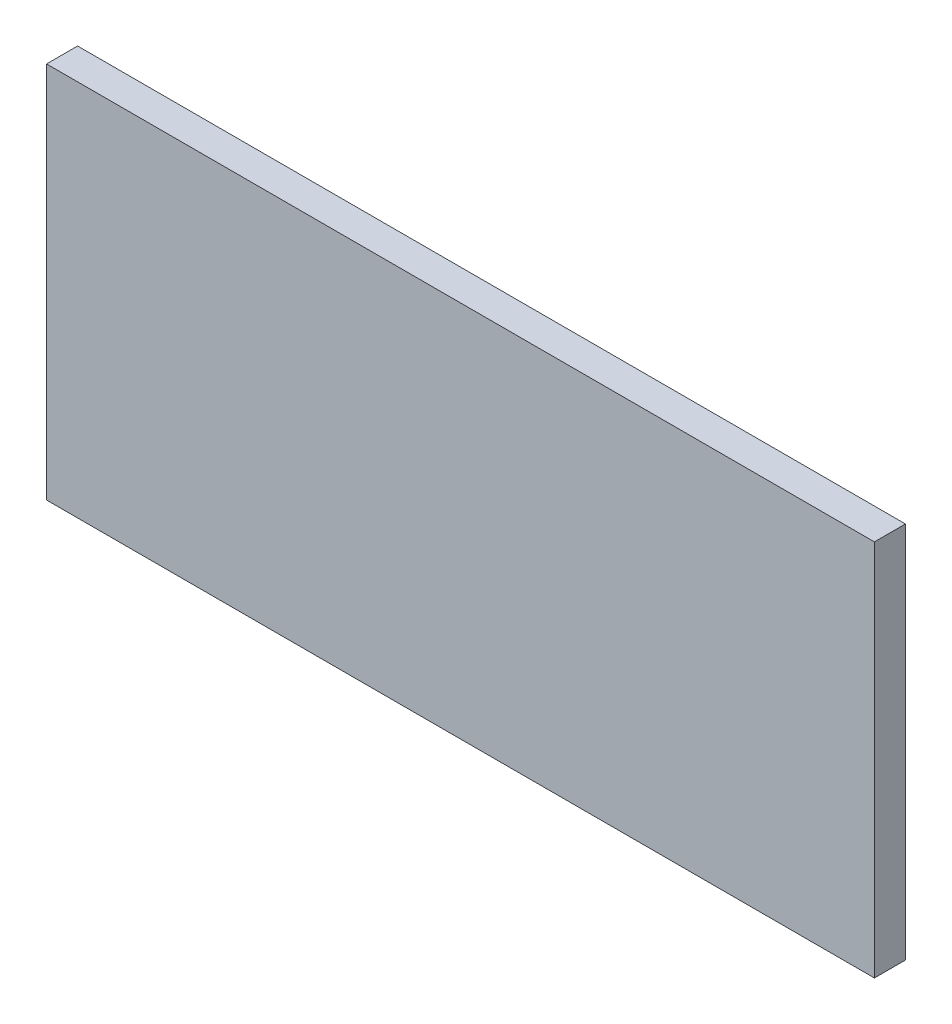
ISO-10303-21;
HEADER;
FILE_DESCRIPTION(('STEP AP214'),'2;1');
FILE_NAME('part.step','',(''),(''),'','','');
FILE_SCHEMA(('AUTOMOTIVE_DESIGN { 1 0 10303 214 1 1 1 1 }'));
ENDSEC;
DATA;
#1=APPLICATION_CONTEXT('core data for automotive mechanical design processes');
#2=APPLICATION_PROTOCOL_DEFINITION('international standard','automotive_design',2000,#1);
#3=PRODUCT_CONTEXT('',#1,'mechanical');
#4=PRODUCT('Part','Part','',(#3));
#5=PRODUCT_RELATED_PRODUCT_CATEGORY('part','',(#4));
#6=PRODUCT_DEFINITION_FORMATION('','',#4);
#7=PRODUCT_DEFINITION_CONTEXT('part definition',#1,'design');
#8=PRODUCT_DEFINITION('design','',#6,#7);
#9=PRODUCT_DEFINITION_SHAPE('','',#8);
#10=(LENGTH_UNIT() NAMED_UNIT(*) SI_UNIT(.MILLI.,.METRE.));
#11=(NAMED_UNIT(*) PLANE_ANGLE_UNIT() SI_UNIT($,.RADIAN.));
#12=(NAMED_UNIT(*) SI_UNIT($,.STERADIAN.) SOLID_ANGLE_UNIT());
#13=UNCERTAINTY_MEASURE_WITH_UNIT(LENGTH_MEASURE(1.E-05),#10,'distance_accuracy_value','');
#14=(GEOMETRIC_REPRESENTATION_CONTEXT(3) GLOBAL_UNCERTAINTY_ASSIGNED_CONTEXT((#13)) GLOBAL_UNIT_ASSIGNED_CONTEXT((#10,
#11,#12)) REPRESENTATION_CONTEXT('',''));
#15=CARTESIAN_POINT('',(0.,0.,0.));
#16=DIRECTION('',(0.,0.,1.));
#17=DIRECTION('',(1.,0.,0.));
#18=AXIS2_PLACEMENT_3D('',#15,#16,#17);
#19=CARTESIAN_POINT('',(0.,0.,-3.00000000000001));
#20=DIRECTION('',(-1.,0.,0.));
#21=DIRECTION('',(0.,0.,1.));
#22=AXIS2_PLACEMENT_3D('',#19,#20,#21);
#23=PLANE('',#22);
#24=DIRECTION('',(0.,-1.,0.));
#25=VECTOR('',#24,1.);
#26=CARTESIAN_POINT('',(0.,0.,0.));
#27=LINE('',#26,#25);
#28=CARTESIAN_POINT('',(0.,36.5,0.));
#29=VERTEX_POINT('',#28);
#30=CARTESIAN_POINT('',(0.,0.,0.));
#31=VERTEX_POINT('',#30);
#32=EDGE_CURVE('E97',#29,#31,#27,.T.);
#33=ORIENTED_EDGE('',*,*,#32,.F.);
#34=DIRECTION('',(0.,0.,1.));
#35=VECTOR('',#34,1.);
#36=CARTESIAN_POINT('',(0.,36.5,-3.00000000000001));
#37=LINE('',#36,#35);
#38=CARTESIAN_POINT('',(0.,36.5,-3.00000000000001));
#39=VERTEX_POINT('',#38);
#40=EDGE_CURVE('E11',#39,#29,#37,.T.);
#41=ORIENTED_EDGE('',*,*,#40,.F.);
#42=DIRECTION('',(0.,-1.,0.));
#43=VECTOR('',#42,1.);
#44=CARTESIAN_POINT('',(0.,0.,-3.00000000000001));
#45=LINE('',#44,#43);
#46=CARTESIAN_POINT('',(0.,0.,-3.00000000000001));
#47=VERTEX_POINT('',#46);
#48=EDGE_CURVE('E91',#39,#47,#45,.T.);
#49=ORIENTED_EDGE('',*,*,#48,.T.);
#50=DIRECTION('',(0.,0.,1.));
#51=VECTOR('',#50,1.);
#52=CARTESIAN_POINT('',(0.,0.,-3.00000000000001));
#53=LINE('',#52,#51);
#54=EDGE_CURVE('E36',#47,#31,#53,.T.);
#55=ORIENTED_EDGE('',*,*,#54,.T.);
#56=EDGE_LOOP('',(#33,#41,#49,#55));
#57=FACE_BOUND('',#56,.T.);
#58=ADVANCED_FACE('F33',(#57),#23,.T.);
#59=CARTESIAN_POINT('',(0.,36.5,-3.00000000000001));
#60=DIRECTION('',(0.,1.,0.));
#61=DIRECTION('',(0.,0.,1.));
#62=AXIS2_PLACEMENT_3D('',#59,#60,#61);
#63=PLANE('',#62);
#64=DIRECTION('',(-1.,0.,0.));
#65=VECTOR('',#64,1.);
#66=CARTESIAN_POINT('',(0.,36.5,0.));
#67=LINE('',#66,#65);
#68=CARTESIAN_POINT('',(80.,36.5,0.));
#69=VERTEX_POINT('',#68);
#70=EDGE_CURVE('E93',#69,#29,#67,.T.);
#71=ORIENTED_EDGE('',*,*,#70,.F.);
#72=DIRECTION('',(0.,0.,1.));
#73=VECTOR('',#72,1.);
#74=CARTESIAN_POINT('',(80.,36.5,-3.00000000000001));
#75=LINE('',#74,#73);
#76=CARTESIAN_POINT('',(80.,36.5,-3.00000000000001));
#77=VERTEX_POINT('',#76);
#78=EDGE_CURVE('E42',#77,#69,#75,.T.);
#79=ORIENTED_EDGE('',*,*,#78,.F.);
#80=DIRECTION('',(-1.,0.,0.));
#81=VECTOR('',#80,1.);
#82=CARTESIAN_POINT('',(0.,36.5,-3.00000000000001));
#83=LINE('',#82,#81);
#84=EDGE_CURVE('E88',#77,#39,#83,.T.);
#85=ORIENTED_EDGE('',*,*,#84,.T.);
#86=ORIENTED_EDGE('',*,*,#40,.T.);
#87=EDGE_LOOP('',(#71,#79,#85,#86));
#88=FACE_BOUND('',#87,.T.);
#89=ADVANCED_FACE('F107',(#88),#63,.T.);
#90=CARTESIAN_POINT('',(80.,0.,-3.00000000000001));
#91=DIRECTION('',(1.,0.,0.));
#92=DIRECTION('',(0.,0.,-1.));
#93=AXIS2_PLACEMENT_3D('',#90,#91,#92);
#94=PLANE('',#93);
#95=DIRECTION('',(0.,1.,0.));
#96=VECTOR('',#95,1.);
#97=CARTESIAN_POINT('',(80.,0.,0.));
#98=LINE('',#97,#96);
#99=CARTESIAN_POINT('',(80.,0.,0.));
#100=VERTEX_POINT('',#99);
#101=EDGE_CURVE('E83',#100,#69,#98,.T.);
#102=ORIENTED_EDGE('',*,*,#101,.F.);
#103=DIRECTION('',(0.,0.,1.));
#104=VECTOR('',#103,1.);
#105=CARTESIAN_POINT('',(80.,0.,-3.00000000000001));
#106=LINE('',#105,#104);
#107=CARTESIAN_POINT('',(80.,0.,-3.00000000000001));
#108=VERTEX_POINT('',#107);
#109=EDGE_CURVE('E78',#108,#100,#106,.T.);
#110=ORIENTED_EDGE('',*,*,#109,.F.);
#111=DIRECTION('',(0.,1.,0.));
#112=VECTOR('',#111,1.);
#113=CARTESIAN_POINT('',(80.,0.,-3.00000000000001));
#114=LINE('',#113,#112);
#115=EDGE_CURVE('E81',#108,#77,#114,.T.);
#116=ORIENTED_EDGE('',*,*,#115,.T.);
#117=ORIENTED_EDGE('',*,*,#78,.T.);
#118=EDGE_LOOP('',(#102,#110,#116,#117));
#119=FACE_BOUND('',#118,.T.);
#120=ADVANCED_FACE('F80',(#119),#94,.T.);
#121=CARTESIAN_POINT('',(0.,0.,-3.00000000000001));
#122=DIRECTION('',(0.,-1.,0.));
#123=DIRECTION('',(0.,0.,-1.));
#124=AXIS2_PLACEMENT_3D('',#121,#122,#123);
#125=PLANE('',#124);
#126=DIRECTION('',(1.,0.,0.));
#127=VECTOR('',#126,1.);
#128=CARTESIAN_POINT('',(0.,0.,0.));
#129=LINE('',#128,#127);
#130=EDGE_CURVE('E100',#31,#100,#129,.T.);
#131=ORIENTED_EDGE('',*,*,#130,.F.);
#132=ORIENTED_EDGE('',*,*,#54,.F.);
#133=DIRECTION('',(1.,0.,0.));
#134=VECTOR('',#133,1.);
#135=CARTESIAN_POINT('',(0.,0.,-3.00000000000001));
#136=LINE('',#135,#134);
#137=EDGE_CURVE('E87',#47,#108,#136,.T.);
#138=ORIENTED_EDGE('',*,*,#137,.T.);
#139=ORIENTED_EDGE('',*,*,#109,.T.);
#140=EDGE_LOOP('',(#131,#132,#138,#139));
#141=FACE_BOUND('',#140,.T.);
#142=ADVANCED_FACE('F90',(#141),#125,.T.);
#143=CARTESIAN_POINT('',(0.,0.,-3.00000000000001));
#144=DIRECTION('',(0.,0.,-1.));
#145=DIRECTION('',(-1.,0.,0.));
#146=AXIS2_PLACEMENT_3D('',#143,#144,#145);
#147=PLANE('',#146);
#148=ORIENTED_EDGE('',*,*,#48,.F.);
#149=ORIENTED_EDGE('',*,*,#84,.F.);
#150=ORIENTED_EDGE('',*,*,#115,.F.);
#151=ORIENTED_EDGE('',*,*,#137,.F.);
#152=EDGE_LOOP('',(#148,#149,#150,#151));
#153=FACE_BOUND('',#152,.T.);
#154=ADVANCED_FACE('F86',(#153),#147,.T.);
#155=CARTESIAN_POINT('',(0.,0.,0.));
#156=DIRECTION('',(0.,0.,-1.));
#157=DIRECTION('',(-1.,0.,0.));
#158=AXIS2_PLACEMENT_3D('',#155,#156,#157);
#159=PLANE('',#158);
#160=ORIENTED_EDGE('',*,*,#32,.T.);
#161=ORIENTED_EDGE('',*,*,#130,.T.);
#162=ORIENTED_EDGE('',*,*,#101,.T.);
#163=ORIENTED_EDGE('',*,*,#70,.T.);
#164=EDGE_LOOP('',(#160,#161,#162,#163));
#165=FACE_BOUND('',#164,.T.);
#166=ADVANCED_FACE('F106',(#165),#159,.F.);
#167=CLOSED_SHELL('',(#58,#89,#120,#142,#154,#166));
#168=MANIFOLD_SOLID_BREP('B2',#167);
#169=ADVANCED_BREP_SHAPE_REPRESENTATION('',(#18,#168),#14);
#170=SHAPE_DEFINITION_REPRESENTATION(#9,#169);
ENDSEC;
END-ISO-10303-21;
